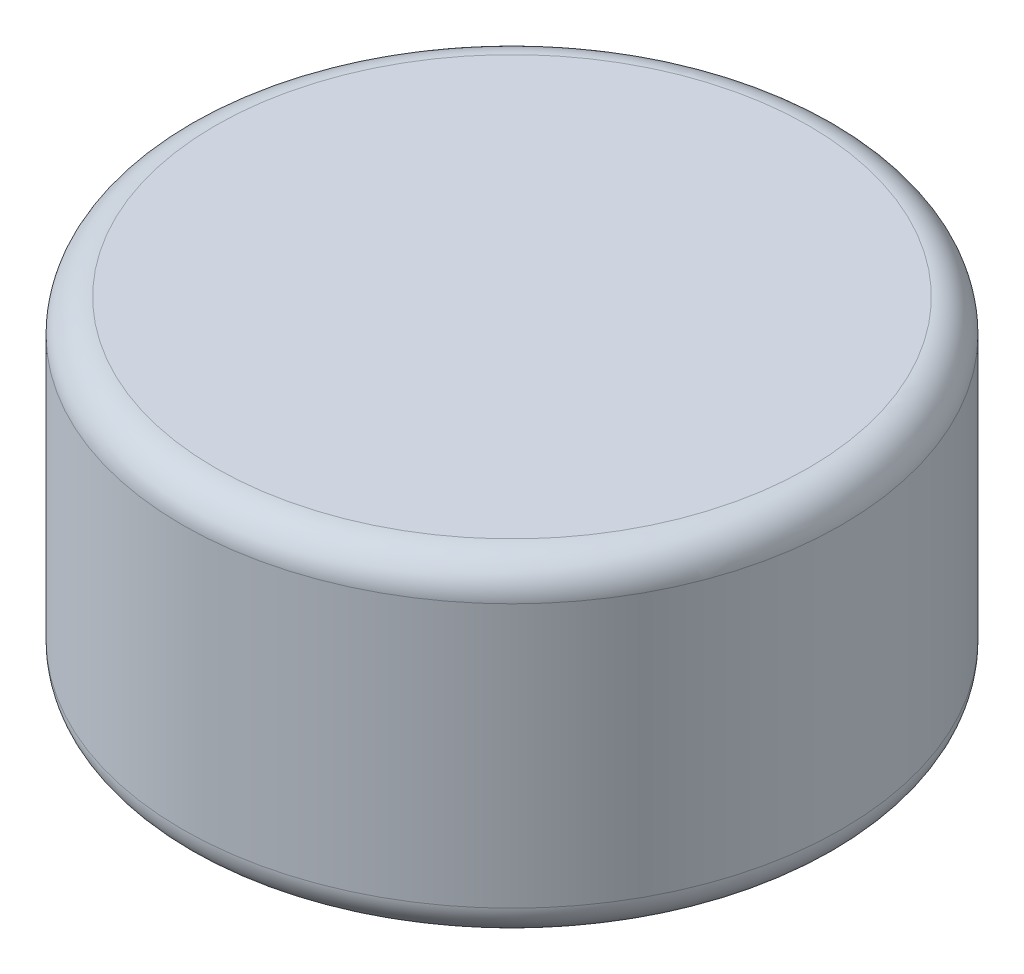
ISO-10303-21;
HEADER;
FILE_DESCRIPTION(('STEP AP214'),'2;1');
FILE_NAME('part.step','',(''),(''),'','','');
FILE_SCHEMA(('AUTOMOTIVE_DESIGN { 1 0 10303 214 1 1 1 1 }'));
ENDSEC;
DATA;
#1=APPLICATION_CONTEXT('core data for automotive mechanical design processes');
#2=APPLICATION_PROTOCOL_DEFINITION('international standard','automotive_design',2000,#1);
#3=PRODUCT_CONTEXT('',#1,'mechanical');
#4=PRODUCT('Part','Part','',(#3));
#5=PRODUCT_RELATED_PRODUCT_CATEGORY('part','',(#4));
#6=PRODUCT_DEFINITION_FORMATION('','',#4);
#7=PRODUCT_DEFINITION_CONTEXT('part definition',#1,'design');
#8=PRODUCT_DEFINITION('design','',#6,#7);
#9=PRODUCT_DEFINITION_SHAPE('','',#8);
#10=(LENGTH_UNIT() NAMED_UNIT(*) SI_UNIT(.MILLI.,.METRE.));
#11=(NAMED_UNIT(*) PLANE_ANGLE_UNIT() SI_UNIT($,.RADIAN.));
#12=(NAMED_UNIT(*) SI_UNIT($,.STERADIAN.) SOLID_ANGLE_UNIT());
#13=UNCERTAINTY_MEASURE_WITH_UNIT(LENGTH_MEASURE(1.E-05),#10,'distance_accuracy_value','');
#14=(GEOMETRIC_REPRESENTATION_CONTEXT(3) GLOBAL_UNCERTAINTY_ASSIGNED_CONTEXT((#13)) GLOBAL_UNIT_ASSIGNED_CONTEXT((#10,
#11,#12)) REPRESENTATION_CONTEXT('',''));
#15=CARTESIAN_POINT('',(0.,0.,0.));
#16=DIRECTION('',(0.,0.,1.));
#17=DIRECTION('',(1.,0.,0.));
#18=AXIS2_PLACEMENT_3D('',#15,#16,#17);
#19=CARTESIAN_POINT('',(0.,1.,0.));
#20=DIRECTION('',(0.,-1.,0.));
#21=DIRECTION('',(0.,0.,-1.));
#22=AXIS2_PLACEMENT_3D('',#19,#20,#21);
#23=CYLINDRICAL_SURFACE('',#22,2.);
#24=CARTESIAN_POINT('',(0.,-0.8,0.));
#25=DIRECTION('',(0.,1.,0.));
#26=DIRECTION('',(0.,0.,1.));
#27=AXIS2_PLACEMENT_3D('',#24,#25,#26);
#28=CIRCLE('',#27,2.);
#29=CARTESIAN_POINT('',(0.,-0.8,2.));
#30=VERTEX_POINT('',#29);
#31=EDGE_CURVE('E45',#30,#30,#28,.T.);
#32=ORIENTED_EDGE('',*,*,#31,.T.);
#33=EDGE_LOOP('',(#32));
#34=FACE_BOUND('',#33,.T.);
#35=CARTESIAN_POINT('',(0.,0.8,0.));
#36=DIRECTION('',(0.,1.,0.));
#37=DIRECTION('',(0.,0.,1.));
#38=AXIS2_PLACEMENT_3D('',#35,#36,#37);
#39=CIRCLE('',#38,2.);
#40=CARTESIAN_POINT('',(0.,0.8,2.));
#41=VERTEX_POINT('',#40);
#42=EDGE_CURVE('E49',#41,#41,#39,.F.);
#43=ORIENTED_EDGE('',*,*,#42,.T.);
#44=EDGE_LOOP('',(#43));
#45=FACE_BOUND('',#44,.T.);
#46=ADVANCED_FACE('F34',(#34,#45),#23,.T.);
#47=CARTESIAN_POINT('',(0.,1.,0.));
#48=DIRECTION('',(0.,1.,0.));
#49=DIRECTION('',(0.,0.,1.));
#50=AXIS2_PLACEMENT_3D('',#47,#48,#49);
#51=PLANE('',#50);
#52=CARTESIAN_POINT('',(0.,1.,0.));
#53=DIRECTION('',(0.,1.,0.));
#54=DIRECTION('',(0.,0.,1.));
#55=AXIS2_PLACEMENT_3D('',#52,#53,#54);
#56=CIRCLE('',#55,1.8);
#57=CARTESIAN_POINT('',(0.,1.,1.8));
#58=VERTEX_POINT('',#57);
#59=EDGE_CURVE('E10',#58,#58,#56,.T.);
#60=ORIENTED_EDGE('',*,*,#59,.T.);
#61=EDGE_LOOP('',(#60));
#62=FACE_BOUND('',#61,.T.);
#63=ADVANCED_FACE('F65',(#62),#51,.T.);
#64=CARTESIAN_POINT('',(0.,-1.,0.));
#65=DIRECTION('',(0.,1.,0.));
#66=DIRECTION('',(0.,0.,1.));
#67=AXIS2_PLACEMENT_3D('',#64,#65,#66);
#68=PLANE('',#67);
#69=CARTESIAN_POINT('',(0.,-1.,0.));
#70=DIRECTION('',(0.,1.,0.));
#71=DIRECTION('',(0.,0.,1.));
#72=AXIS2_PLACEMENT_3D('',#69,#70,#71);
#73=CIRCLE('',#72,1.8);
#74=CARTESIAN_POINT('',(0.,-1.,1.8));
#75=VERTEX_POINT('',#74);
#76=EDGE_CURVE('E41',#75,#75,#73,.F.);
#77=ORIENTED_EDGE('',*,*,#76,.T.);
#78=EDGE_LOOP('',(#77));
#79=FACE_BOUND('',#78,.T.);
#80=ADVANCED_FACE('F62',(#79),#68,.F.);
#81=CARTESIAN_POINT('',(0.,-0.8,0.));
#82=DIRECTION('',(0.,1.,0.));
#83=DIRECTION('',(0.,0.,1.));
#84=AXIS2_PLACEMENT_3D('',#81,#82,#83);
#85=TOROIDAL_SURFACE('',#84,1.8,0.2);
#86=ORIENTED_EDGE('',*,*,#76,.F.);
#87=EDGE_LOOP('',(#86));
#88=FACE_BOUND('',#87,.T.);
#89=ORIENTED_EDGE('',*,*,#31,.F.);
#90=EDGE_LOOP('',(#89));
#91=FACE_BOUND('',#90,.T.);
#92=ADVANCED_FACE('F58',(#88,#91),#85,.T.);
#93=CARTESIAN_POINT('',(0.,0.8,0.));
#94=DIRECTION('',(0.,1.,0.));
#95=DIRECTION('',(0.,0.,1.));
#96=AXIS2_PLACEMENT_3D('',#93,#94,#95);
#97=TOROIDAL_SURFACE('',#96,1.8,0.2);
#98=ORIENTED_EDGE('',*,*,#42,.F.);
#99=EDGE_LOOP('',(#98));
#100=FACE_BOUND('',#99,.T.);
#101=ORIENTED_EDGE('',*,*,#59,.F.);
#102=EDGE_LOOP('',(#101));
#103=FACE_BOUND('',#102,.T.);
#104=ADVANCED_FACE('F36',(#100,#103),#97,.T.);
#105=CLOSED_SHELL('',(#46,#63,#80,#92,#104));
#106=MANIFOLD_SOLID_BREP('B2',#105);
#107=ADVANCED_BREP_SHAPE_REPRESENTATION('',(#18,#106),#14);
#108=SHAPE_DEFINITION_REPRESENTATION(#9,#107);
ENDSEC;
END-ISO-10303-21;
